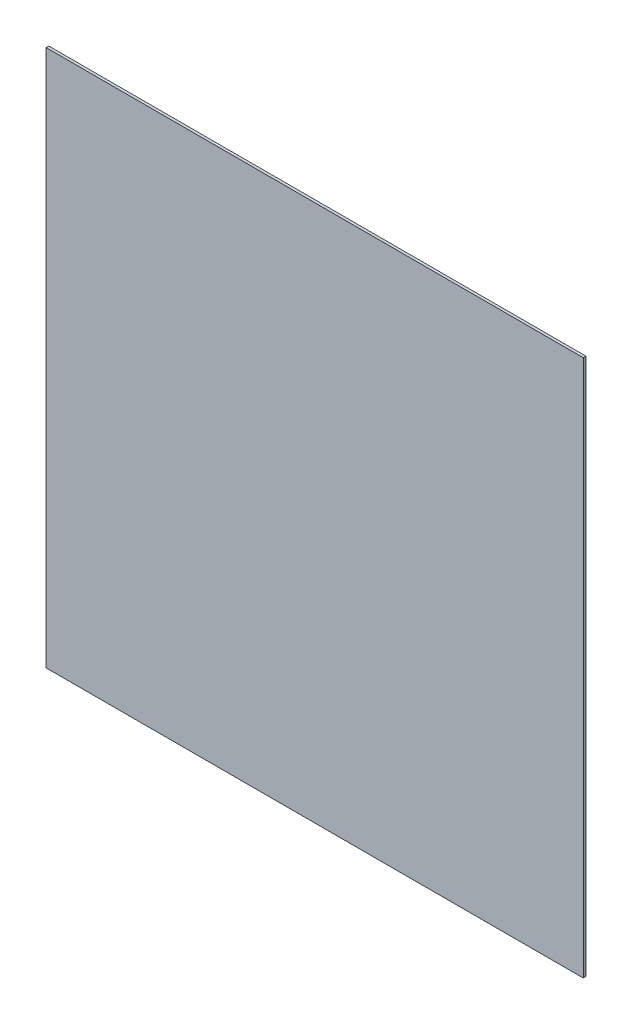
ISO-10303-21;
HEADER;
FILE_DESCRIPTION(('STEP AP214'),'2;1');
FILE_NAME('part.step','',(''),(''),'','','');
FILE_SCHEMA(('AUTOMOTIVE_DESIGN { 1 0 10303 214 1 1 1 1 }'));
ENDSEC;
DATA;
#1=APPLICATION_CONTEXT('core data for automotive mechanical design processes');
#2=APPLICATION_PROTOCOL_DEFINITION('international standard','automotive_design',2000,#1);
#3=PRODUCT_CONTEXT('',#1,'mechanical');
#4=PRODUCT('Part','Part','',(#3));
#5=PRODUCT_RELATED_PRODUCT_CATEGORY('part','',(#4));
#6=PRODUCT_DEFINITION_FORMATION('','',#4);
#7=PRODUCT_DEFINITION_CONTEXT('part definition',#1,'design');
#8=PRODUCT_DEFINITION('design','',#6,#7);
#9=PRODUCT_DEFINITION_SHAPE('','',#8);
#10=(LENGTH_UNIT() NAMED_UNIT(*) SI_UNIT(.MILLI.,.METRE.));
#11=(NAMED_UNIT(*) PLANE_ANGLE_UNIT() SI_UNIT($,.RADIAN.));
#12=(NAMED_UNIT(*) SI_UNIT($,.STERADIAN.) SOLID_ANGLE_UNIT());
#13=UNCERTAINTY_MEASURE_WITH_UNIT(LENGTH_MEASURE(1.E-05),#10,'distance_accuracy_value','');
#14=(GEOMETRIC_REPRESENTATION_CONTEXT(3) GLOBAL_UNCERTAINTY_ASSIGNED_CONTEXT((#13)) GLOBAL_UNIT_ASSIGNED_CONTEXT((#10,
#11,#12)) REPRESENTATION_CONTEXT('',''));
#15=CARTESIAN_POINT('',(0.,0.,0.));
#16=DIRECTION('',(0.,0.,1.));
#17=DIRECTION('',(1.,0.,0.));
#18=AXIS2_PLACEMENT_3D('',#15,#16,#17);
#19=CARTESIAN_POINT('',(-100.,100.,1.));
#20=DIRECTION('',(1.,0.,0.));
#21=DIRECTION('',(0.,0.,-1.));
#22=AXIS2_PLACEMENT_3D('',#19,#20,#21);
#23=PLANE('',#22);
#24=DIRECTION('',(0.,-1.,0.));
#25=VECTOR('',#24,1.);
#26=CARTESIAN_POINT('',(-100.,100.,0.));
#27=LINE('',#26,#25);
#28=CARTESIAN_POINT('',(-100.,100.,0.));
#29=VERTEX_POINT('',#28);
#30=CARTESIAN_POINT('',(-100.,-100.,0.));
#31=VERTEX_POINT('',#30);
#32=EDGE_CURVE('E97',#29,#31,#27,.T.);
#33=ORIENTED_EDGE('',*,*,#32,.T.);
#34=DIRECTION('',(0.,0.,-1.));
#35=VECTOR('',#34,1.);
#36=CARTESIAN_POINT('',(-100.,-100.,1.));
#37=LINE('',#36,#35);
#38=CARTESIAN_POINT('',(-100.,-100.,1.));
#39=VERTEX_POINT('',#38);
#40=EDGE_CURVE('E11',#39,#31,#37,.T.);
#41=ORIENTED_EDGE('',*,*,#40,.F.);
#42=DIRECTION('',(0.,-1.,0.));
#43=VECTOR('',#42,1.);
#44=CARTESIAN_POINT('',(-100.,100.,1.));
#45=LINE('',#44,#43);
#46=CARTESIAN_POINT('',(-100.,100.,1.));
#47=VERTEX_POINT('',#46);
#48=EDGE_CURVE('E85',#47,#39,#45,.T.);
#49=ORIENTED_EDGE('',*,*,#48,.F.);
#50=DIRECTION('',(0.,0.,-1.));
#51=VECTOR('',#50,1.);
#52=CARTESIAN_POINT('',(-100.,100.,1.));
#53=LINE('',#52,#51);
#54=EDGE_CURVE('E93',#47,#29,#53,.T.);
#55=ORIENTED_EDGE('',*,*,#54,.T.);
#56=EDGE_LOOP('',(#33,#41,#49,#55));
#57=FACE_BOUND('',#56,.T.);
#58=ADVANCED_FACE('F34',(#57),#23,.F.);
#59=CARTESIAN_POINT('',(-100.,-100.,1.));
#60=DIRECTION('',(0.,1.,0.));
#61=DIRECTION('',(0.,0.,1.));
#62=AXIS2_PLACEMENT_3D('',#59,#60,#61);
#63=PLANE('',#62);
#64=DIRECTION('',(1.,0.,0.));
#65=VECTOR('',#64,1.);
#66=CARTESIAN_POINT('',(-100.,-100.,0.));
#67=LINE('',#66,#65);
#68=CARTESIAN_POINT('',(100.,-100.,0.));
#69=VERTEX_POINT('',#68);
#70=EDGE_CURVE('E89',#31,#69,#67,.T.);
#71=ORIENTED_EDGE('',*,*,#70,.T.);
#72=DIRECTION('',(0.,0.,-1.));
#73=VECTOR('',#72,1.);
#74=CARTESIAN_POINT('',(100.,-100.,1.));
#75=LINE('',#74,#73);
#76=CARTESIAN_POINT('',(100.,-100.,1.));
#77=VERTEX_POINT('',#76);
#78=EDGE_CURVE('E42',#77,#69,#75,.T.);
#79=ORIENTED_EDGE('',*,*,#78,.F.);
#80=DIRECTION('',(1.,0.,0.));
#81=VECTOR('',#80,1.);
#82=CARTESIAN_POINT('',(-100.,-100.,1.));
#83=LINE('',#82,#81);
#84=EDGE_CURVE('E80',#39,#77,#83,.T.);
#85=ORIENTED_EDGE('',*,*,#84,.F.);
#86=ORIENTED_EDGE('',*,*,#40,.T.);
#87=EDGE_LOOP('',(#71,#79,#85,#86));
#88=FACE_BOUND('',#87,.T.);
#89=ADVANCED_FACE('F88',(#88),#63,.F.);
#90=CARTESIAN_POINT('',(100.,100.,1.));
#91=DIRECTION('',(-1.,0.,0.));
#92=DIRECTION('',(0.,0.,1.));
#93=AXIS2_PLACEMENT_3D('',#90,#91,#92);
#94=PLANE('',#93);
#95=DIRECTION('',(0.,1.,0.));
#96=VECTOR('',#95,1.);
#97=CARTESIAN_POINT('',(100.,100.,0.));
#98=LINE('',#97,#96);
#99=CARTESIAN_POINT('',(100.,100.,0.));
#100=VERTEX_POINT('',#99);
#101=EDGE_CURVE('E67',#69,#100,#98,.T.);
#102=ORIENTED_EDGE('',*,*,#101,.T.);
#103=DIRECTION('',(0.,0.,-1.));
#104=VECTOR('',#103,1.);
#105=CARTESIAN_POINT('',(100.,100.,1.));
#106=LINE('',#105,#104);
#107=CARTESIAN_POINT('',(100.,100.,1.));
#108=VERTEX_POINT('',#107);
#109=EDGE_CURVE('E90',#108,#100,#106,.T.);
#110=ORIENTED_EDGE('',*,*,#109,.F.);
#111=DIRECTION('',(0.,1.,0.));
#112=VECTOR('',#111,1.);
#113=CARTESIAN_POINT('',(100.,100.,1.));
#114=LINE('',#113,#112);
#115=EDGE_CURVE('E83',#77,#108,#114,.T.);
#116=ORIENTED_EDGE('',*,*,#115,.F.);
#117=ORIENTED_EDGE('',*,*,#78,.T.);
#118=EDGE_LOOP('',(#102,#110,#116,#117));
#119=FACE_BOUND('',#118,.T.);
#120=ADVANCED_FACE('F91',(#119),#94,.F.);
#121=CARTESIAN_POINT('',(-100.,100.,1.));
#122=DIRECTION('',(0.,-1.,0.));
#123=DIRECTION('',(0.,0.,-1.));
#124=AXIS2_PLACEMENT_3D('',#121,#122,#123);
#125=PLANE('',#124);
#126=DIRECTION('',(-1.,0.,0.));
#127=VECTOR('',#126,1.);
#128=CARTESIAN_POINT('',(-100.,100.,0.));
#129=LINE('',#128,#127);
#130=EDGE_CURVE('E73',#100,#29,#129,.T.);
#131=ORIENTED_EDGE('',*,*,#130,.T.);
#132=ORIENTED_EDGE('',*,*,#54,.F.);
#133=DIRECTION('',(-1.,0.,0.));
#134=VECTOR('',#133,1.);
#135=CARTESIAN_POINT('',(-100.,100.,1.));
#136=LINE('',#135,#134);
#137=EDGE_CURVE('E50',#108,#47,#136,.T.);
#138=ORIENTED_EDGE('',*,*,#137,.F.);
#139=ORIENTED_EDGE('',*,*,#109,.T.);
#140=EDGE_LOOP('',(#131,#132,#138,#139));
#141=FACE_BOUND('',#140,.T.);
#142=ADVANCED_FACE('F104',(#141),#125,.F.);
#143=CARTESIAN_POINT('',(0.,0.,1.));
#144=DIRECTION('',(0.,0.,1.));
#145=DIRECTION('',(1.,0.,0.));
#146=AXIS2_PLACEMENT_3D('',#143,#144,#145);
#147=PLANE('',#146);
#148=ORIENTED_EDGE('',*,*,#48,.T.);
#149=ORIENTED_EDGE('',*,*,#84,.T.);
#150=ORIENTED_EDGE('',*,*,#115,.T.);
#151=ORIENTED_EDGE('',*,*,#137,.T.);
#152=EDGE_LOOP('',(#148,#149,#150,#151));
#153=FACE_BOUND('',#152,.T.);
#154=ADVANCED_FACE('F81',(#153),#147,.T.);
#155=CARTESIAN_POINT('',(0.,0.,0.));
#156=DIRECTION('',(0.,0.,1.));
#157=DIRECTION('',(1.,0.,0.));
#158=AXIS2_PLACEMENT_3D('',#155,#156,#157);
#159=PLANE('',#158);
#160=ORIENTED_EDGE('',*,*,#32,.F.);
#161=ORIENTED_EDGE('',*,*,#130,.F.);
#162=ORIENTED_EDGE('',*,*,#101,.F.);
#163=ORIENTED_EDGE('',*,*,#70,.F.);
#164=EDGE_LOOP('',(#160,#161,#162,#163));
#165=FACE_BOUND('',#164,.T.);
#166=ADVANCED_FACE('F107',(#165),#159,.F.);
#167=CLOSED_SHELL('',(#58,#89,#120,#142,#154,#166));
#168=MANIFOLD_SOLID_BREP('B2',#167);
#169=ADVANCED_BREP_SHAPE_REPRESENTATION('',(#18,#168),#14);
#170=SHAPE_DEFINITION_REPRESENTATION(#9,#169);
ENDSEC;
END-ISO-10303-21;
